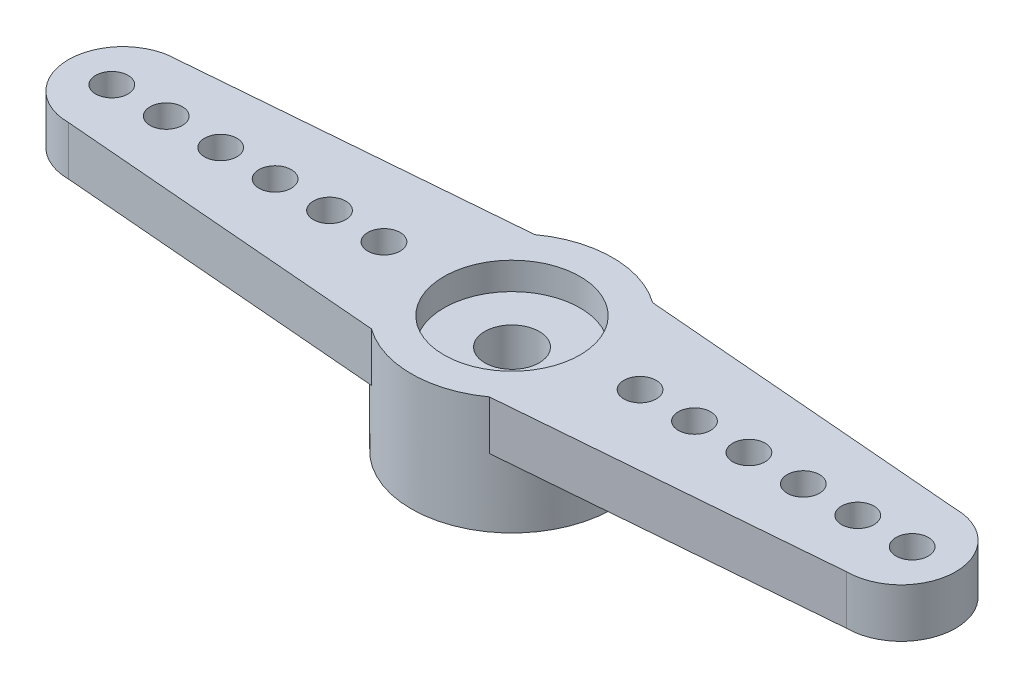
ISO-10303-21;
HEADER;
FILE_DESCRIPTION(('STEP AP214'),'2;1');
FILE_NAME('part.step','',(''),(''),'','','');
FILE_SCHEMA(('AUTOMOTIVE_DESIGN { 1 0 10303 214 1 1 1 1 }'));
ENDSEC;
DATA;
#1=APPLICATION_CONTEXT('core data for automotive mechanical design processes');
#2=APPLICATION_PROTOCOL_DEFINITION('international standard','automotive_design',2000,#1);
#3=PRODUCT_CONTEXT('',#1,'mechanical');
#4=PRODUCT('Part','Part','',(#3));
#5=PRODUCT_RELATED_PRODUCT_CATEGORY('part','',(#4));
#6=PRODUCT_DEFINITION_FORMATION('','',#4);
#7=PRODUCT_DEFINITION_CONTEXT('part definition',#1,'design');
#8=PRODUCT_DEFINITION('design','',#6,#7);
#9=PRODUCT_DEFINITION_SHAPE('','',#8);
#10=(LENGTH_UNIT() NAMED_UNIT(*) SI_UNIT(.MILLI.,.METRE.));
#11=(NAMED_UNIT(*) PLANE_ANGLE_UNIT() SI_UNIT($,.RADIAN.));
#12=(NAMED_UNIT(*) SI_UNIT($,.STERADIAN.) SOLID_ANGLE_UNIT());
#13=UNCERTAINTY_MEASURE_WITH_UNIT(LENGTH_MEASURE(1.E-05),#10,'distance_accuracy_value','');
#14=(GEOMETRIC_REPRESENTATION_CONTEXT(3) GLOBAL_UNCERTAINTY_ASSIGNED_CONTEXT((#13)) GLOBAL_UNIT_ASSIGNED_CONTEXT((#10,
#11,#12)) REPRESENTATION_CONTEXT('',''));
#15=CARTESIAN_POINT('',(0.,0.,0.));
#16=DIRECTION('',(0.,0.,1.));
#17=DIRECTION('',(1.,0.,0.));
#18=AXIS2_PLACEMENT_3D('',#15,#16,#17);
#19=CARTESIAN_POINT('',(0.,4.3,0.));
#20=DIRECTION('',(0.,-1.,0.));
#21=DIRECTION('',(0.,0.,-1.));
#22=AXIS2_PLACEMENT_3D('',#19,#20,#21);
#23=CYLINDRICAL_SURFACE('',#22,3.7);
#24=CARTESIAN_POINT('',(0.,4.3,0.));
#25=DIRECTION('',(0.,1.,0.));
#26=DIRECTION('',(0.,0.,1.));
#27=AXIS2_PLACEMENT_3D('',#24,#25,#26);
#28=CIRCLE('',#27,3.7);
#29=CARTESIAN_POINT('',(2.16564,4.3,-3.00000056506661));
#30=VERTEX_POINT('',#29);
#31=CARTESIAN_POINT('',(-2.16564,4.3,-3.00000056506661));
#32=VERTEX_POINT('',#31);
#33=EDGE_CURVE('E122',#30,#32,#28,.T.);
#34=ORIENTED_EDGE('',*,*,#33,.F.);
#35=DIRECTION('',(0.,1.,0.));
#36=VECTOR('',#35,1.);
#37=CARTESIAN_POINT('',(2.16564,2.5,-3.00000056506661));
#38=LINE('',#37,#36);
#39=CARTESIAN_POINT('',(2.16564,2.5,-3.00000056506661));
#40=VERTEX_POINT('',#39);
#41=EDGE_CURVE('E120',#40,#30,#38,.T.);
#42=ORIENTED_EDGE('',*,*,#41,.F.);
#43=CARTESIAN_POINT('',(0.,2.5,0.));
#44=DIRECTION('',(0.,-1.,0.));
#45=DIRECTION('',(0.,0.,-1.));
#46=AXIS2_PLACEMENT_3D('',#43,#44,#45);
#47=CIRCLE('',#46,3.7);
#48=CARTESIAN_POINT('',(2.16564,2.5,3.00000056506661));
#49=VERTEX_POINT('',#48);
#50=EDGE_CURVE('E11',#40,#49,#47,.T.);
#51=ORIENTED_EDGE('',*,*,#50,.T.);
#52=DIRECTION('',(0.,1.,0.));
#53=VECTOR('',#52,1.);
#54=CARTESIAN_POINT('',(2.16564,2.5,3.00000056506661));
#55=LINE('',#54,#53);
#56=CARTESIAN_POINT('',(2.16564,4.3,3.00000056506661));
#57=VERTEX_POINT('',#56);
#58=EDGE_CURVE('E98',#49,#57,#55,.T.);
#59=ORIENTED_EDGE('',*,*,#58,.T.);
#60=CARTESIAN_POINT('',(-2.16564,4.3,3.00000056506661));
#61=VERTEX_POINT('',#60);
#62=EDGE_CURVE('E173',#61,#57,#28,.T.);
#63=ORIENTED_EDGE('',*,*,#62,.F.);
#64=DIRECTION('',(0.,1.,0.));
#65=VECTOR('',#64,1.);
#66=CARTESIAN_POINT('',(-2.16564,2.5,3.00000056506661));
#67=LINE('',#66,#65);
#68=CARTESIAN_POINT('',(-2.16564,2.5,3.00000056506661));
#69=VERTEX_POINT('',#68);
#70=EDGE_CURVE('E150',#69,#61,#67,.T.);
#71=ORIENTED_EDGE('',*,*,#70,.F.);
#72=CARTESIAN_POINT('',(0.,2.5,0.));
#73=DIRECTION('',(0.,1.,0.));
#74=DIRECTION('',(0.,0.,1.));
#75=AXIS2_PLACEMENT_3D('',#72,#73,#74);
#76=CIRCLE('',#75,3.7);
#77=CARTESIAN_POINT('',(-2.16564,2.5,-3.00000056506661));
#78=VERTEX_POINT('',#77);
#79=EDGE_CURVE('E39',#78,#69,#76,.T.);
#80=ORIENTED_EDGE('',*,*,#79,.F.);
#81=DIRECTION('',(0.,1.,0.));
#82=VECTOR('',#81,1.);
#83=CARTESIAN_POINT('',(-2.16564,2.5,-3.00000056506661));
#84=LINE('',#83,#82);
#85=EDGE_CURVE('E147',#78,#32,#84,.T.);
#86=ORIENTED_EDGE('',*,*,#85,.T.);
#87=EDGE_LOOP('',(#34,#42,#51,#59,#63,#71,#80,#86));
#88=FACE_BOUND('',#87,.T.);
#89=CARTESIAN_POINT('',(0.,0.,0.));
#90=DIRECTION('',(0.,1.,0.));
#91=DIRECTION('',(0.,0.,1.));
#92=AXIS2_PLACEMENT_3D('',#89,#90,#91);
#93=CIRCLE('',#92,3.7);
#94=CARTESIAN_POINT('',(0.,0.,3.7));
#95=VERTEX_POINT('',#94);
#96=EDGE_CURVE('E170',#95,#95,#93,.T.);
#97=ORIENTED_EDGE('',*,*,#96,.T.);
#98=EDGE_LOOP('',(#97));
#99=FACE_BOUND('',#98,.T.);
#100=ADVANCED_FACE('F32',(#88,#99),#23,.T.);
#101=CARTESIAN_POINT('',(0.,4.3,0.));
#102=DIRECTION('',(0.,1.,0.));
#103=DIRECTION('',(0.,0.,1.));
#104=AXIS2_PLACEMENT_3D('',#101,#102,#103);
#105=PLANE('',#104);
#106=CARTESIAN_POINT('',(-12.705,4.3,0.));
#107=DIRECTION('',(0.,1.,0.));
#108=DIRECTION('',(0.,0.,1.));
#109=AXIS2_PLACEMENT_3D('',#106,#107,#108);
#110=CIRCLE('',#109,0.595);
#111=CARTESIAN_POINT('',(-12.705,4.3,0.595000000000002));
#112=VERTEX_POINT('',#111);
#113=EDGE_CURVE('E260',#112,#112,#110,.T.);
#114=ORIENTED_EDGE('',*,*,#113,.F.);
#115=EDGE_LOOP('',(#114));
#116=FACE_BOUND('',#115,.T.);
#117=CARTESIAN_POINT('',(-10.705,4.3,0.));
#118=DIRECTION('',(0.,1.,0.));
#119=DIRECTION('',(0.,0.,1.));
#120=AXIS2_PLACEMENT_3D('',#117,#118,#119);
#121=CIRCLE('',#120,0.595);
#122=CARTESIAN_POINT('',(-10.705,4.3,0.595000000000002));
#123=VERTEX_POINT('',#122);
#124=EDGE_CURVE('E254',#123,#123,#121,.T.);
#125=ORIENTED_EDGE('',*,*,#124,.F.);
#126=EDGE_LOOP('',(#125));
#127=FACE_BOUND('',#126,.T.);
#128=CARTESIAN_POINT('',(-8.705,4.3,0.));
#129=DIRECTION('',(0.,1.,0.));
#130=DIRECTION('',(0.,0.,1.));
#131=AXIS2_PLACEMENT_3D('',#128,#129,#130);
#132=CIRCLE('',#131,0.595);
#133=CARTESIAN_POINT('',(-8.705,4.3,0.595000000000002));
#134=VERTEX_POINT('',#133);
#135=EDGE_CURVE('E248',#134,#134,#132,.T.);
#136=ORIENTED_EDGE('',*,*,#135,.F.);
#137=EDGE_LOOP('',(#136));
#138=FACE_BOUND('',#137,.T.);
#139=CARTESIAN_POINT('',(-6.705,4.3,0.));
#140=DIRECTION('',(0.,1.,0.));
#141=DIRECTION('',(0.,0.,1.));
#142=AXIS2_PLACEMENT_3D('',#139,#140,#141);
#143=CIRCLE('',#142,0.595);
#144=CARTESIAN_POINT('',(-6.705,4.3,0.595000000000002));
#145=VERTEX_POINT('',#144);
#146=EDGE_CURVE('E242',#145,#145,#143,.T.);
#147=ORIENTED_EDGE('',*,*,#146,.F.);
#148=EDGE_LOOP('',(#147));
#149=FACE_BOUND('',#148,.T.);
#150=CARTESIAN_POINT('',(-4.705,4.3,0.));
#151=DIRECTION('',(0.,1.,0.));
#152=DIRECTION('',(0.,0.,1.));
#153=AXIS2_PLACEMENT_3D('',#150,#151,#152);
#154=CIRCLE('',#153,0.595);
#155=CARTESIAN_POINT('',(-4.705,4.3,0.595000000000002));
#156=VERTEX_POINT('',#155);
#157=EDGE_CURVE('E236',#156,#156,#154,.T.);
#158=ORIENTED_EDGE('',*,*,#157,.F.);
#159=EDGE_LOOP('',(#158));
#160=FACE_BOUND('',#159,.T.);
#161=CARTESIAN_POINT('',(14.705,4.3,0.));
#162=DIRECTION('',(0.,1.,0.));
#163=DIRECTION('',(0.,0.,-1.));
#164=AXIS2_PLACEMENT_3D('',#161,#162,#163);
#165=CIRCLE('',#164,0.595);
#166=CARTESIAN_POINT('',(14.705,4.3,-0.594999999999998));
#167=VERTEX_POINT('',#166);
#168=EDGE_CURVE('E230',#167,#167,#165,.T.);
#169=ORIENTED_EDGE('',*,*,#168,.F.);
#170=EDGE_LOOP('',(#169));
#171=FACE_BOUND('',#170,.T.);
#172=CARTESIAN_POINT('',(12.705,4.3,0.));
#173=DIRECTION('',(0.,1.,0.));
#174=DIRECTION('',(0.,0.,-1.));
#175=AXIS2_PLACEMENT_3D('',#172,#173,#174);
#176=CIRCLE('',#175,0.595);
#177=CARTESIAN_POINT('',(12.705,4.3,-0.594999999999998));
#178=VERTEX_POINT('',#177);
#179=EDGE_CURVE('E224',#178,#178,#176,.T.);
#180=ORIENTED_EDGE('',*,*,#179,.F.);
#181=EDGE_LOOP('',(#180));
#182=FACE_BOUND('',#181,.T.);
#183=CARTESIAN_POINT('',(10.705,4.3,0.));
#184=DIRECTION('',(0.,1.,0.));
#185=DIRECTION('',(0.,0.,-1.));
#186=AXIS2_PLACEMENT_3D('',#183,#184,#185);
#187=CIRCLE('',#186,0.595);
#188=CARTESIAN_POINT('',(10.705,4.3,-0.594999999999998));
#189=VERTEX_POINT('',#188);
#190=EDGE_CURVE('E218',#189,#189,#187,.T.);
#191=ORIENTED_EDGE('',*,*,#190,.F.);
#192=EDGE_LOOP('',(#191));
#193=FACE_BOUND('',#192,.T.);
#194=CARTESIAN_POINT('',(8.705,4.3,0.));
#195=DIRECTION('',(0.,1.,0.));
#196=DIRECTION('',(0.,0.,-1.));
#197=AXIS2_PLACEMENT_3D('',#194,#195,#196);
#198=CIRCLE('',#197,0.595);
#199=CARTESIAN_POINT('',(8.705,4.3,-0.594999999999998));
#200=VERTEX_POINT('',#199);
#201=EDGE_CURVE('E212',#200,#200,#198,.T.);
#202=ORIENTED_EDGE('',*,*,#201,.F.);
#203=EDGE_LOOP('',(#202));
#204=FACE_BOUND('',#203,.T.);
#205=CARTESIAN_POINT('',(6.705,4.3,0.));
#206=DIRECTION('',(0.,1.,0.));
#207=DIRECTION('',(0.,0.,-1.));
#208=AXIS2_PLACEMENT_3D('',#205,#206,#207);
#209=CIRCLE('',#208,0.595);
#210=CARTESIAN_POINT('',(6.705,4.3,-0.594999999999998));
#211=VERTEX_POINT('',#210);
#212=EDGE_CURVE('E206',#211,#211,#209,.T.);
#213=ORIENTED_EDGE('',*,*,#212,.F.);
#214=EDGE_LOOP('',(#213));
#215=FACE_BOUND('',#214,.T.);
#216=CARTESIAN_POINT('',(4.705,4.3,0.));
#217=DIRECTION('',(0.,1.,0.));
#218=DIRECTION('',(0.,0.,-1.));
#219=AXIS2_PLACEMENT_3D('',#216,#217,#218);
#220=CIRCLE('',#219,0.595);
#221=CARTESIAN_POINT('',(4.705,4.3,-0.594999999999998));
#222=VERTEX_POINT('',#221);
#223=EDGE_CURVE('E200',#222,#222,#220,.T.);
#224=ORIENTED_EDGE('',*,*,#223,.F.);
#225=EDGE_LOOP('',(#224));
#226=FACE_BOUND('',#225,.T.);
#227=CARTESIAN_POINT('',(-14.705,4.3,0.));
#228=DIRECTION('',(0.,1.,0.));
#229=DIRECTION('',(0.,0.,1.));
#230=AXIS2_PLACEMENT_3D('',#227,#228,#229);
#231=CIRCLE('',#230,0.595);
#232=CARTESIAN_POINT('',(-14.705,4.3,0.595000000000002));
#233=VERTEX_POINT('',#232);
#234=EDGE_CURVE('E192',#233,#233,#231,.T.);
#235=ORIENTED_EDGE('',*,*,#234,.F.);
#236=EDGE_LOOP('',(#235));
#237=FACE_BOUND('',#236,.T.);
#238=ORIENTED_EDGE('',*,*,#62,.T.);
#239=DIRECTION('',(0.996621441352037,0.,-0.0821322265459026));
#240=VECTOR('',#239,1.);
#241=CARTESIAN_POINT('',(2.16564,4.3,3.00000056506661));
#242=LINE('',#241,#240);
#243=CARTESIAN_POINT('',(14.3,4.3,2.));
#244=VERTEX_POINT('',#243);
#245=EDGE_CURVE('E103',#57,#244,#242,.T.);
#246=ORIENTED_EDGE('',*,*,#245,.T.);
#247=CARTESIAN_POINT('',(14.3,4.3,0.));
#248=DIRECTION('',(0.,1.,0.));
#249=DIRECTION('',(0.,0.,-1.));
#250=AXIS2_PLACEMENT_3D('',#247,#248,#249);
#251=CIRCLE('',#250,2.);
#252=CARTESIAN_POINT('',(14.3,4.3,-2.));
#253=VERTEX_POINT('',#252);
#254=EDGE_CURVE('E188',#244,#253,#251,.T.);
#255=ORIENTED_EDGE('',*,*,#254,.T.);
#256=DIRECTION('',(-0.996621441352037,0.,-0.0821322265459028));
#257=VECTOR('',#256,1.);
#258=CARTESIAN_POINT('',(2.16564,4.3,-3.00000056506661));
#259=LINE('',#258,#257);
#260=EDGE_CURVE('E46',#253,#30,#259,.T.);
#261=ORIENTED_EDGE('',*,*,#260,.T.);
#262=ORIENTED_EDGE('',*,*,#33,.T.);
#263=DIRECTION('',(-0.996621441352037,0.,0.0821322265459028));
#264=VECTOR('',#263,1.);
#265=CARTESIAN_POINT('',(-2.16564,4.3,-3.00000056506661));
#266=LINE('',#265,#264);
#267=CARTESIAN_POINT('',(-14.3,4.3,-2.));
#268=VERTEX_POINT('',#267);
#269=EDGE_CURVE('E124',#32,#268,#266,.T.);
#270=ORIENTED_EDGE('',*,*,#269,.T.);
#271=CARTESIAN_POINT('',(-14.3,4.3,0.));
#272=DIRECTION('',(0.,1.,0.));
#273=DIRECTION('',(0.,0.,1.));
#274=AXIS2_PLACEMENT_3D('',#271,#272,#273);
#275=CIRCLE('',#274,2.);
#276=CARTESIAN_POINT('',(-14.3,4.3,2.));
#277=VERTEX_POINT('',#276);
#278=EDGE_CURVE('E128',#268,#277,#275,.T.);
#279=ORIENTED_EDGE('',*,*,#278,.T.);
#280=DIRECTION('',(0.996621441352037,0.,0.0821322265459026));
#281=VECTOR('',#280,1.);
#282=CARTESIAN_POINT('',(-2.16564,4.3,3.00000056506661));
#283=LINE('',#282,#281);
#284=EDGE_CURVE('E53',#277,#61,#283,.T.);
#285=ORIENTED_EDGE('',*,*,#284,.T.);
#286=EDGE_LOOP('',(#238,#246,#255,#261,#262,#270,#279,#285));
#287=FACE_BOUND('',#286,.T.);
#288=CARTESIAN_POINT('',(0.,4.3,0.));
#289=DIRECTION('',(0.,1.,0.));
#290=DIRECTION('',(0.,0.,1.));
#291=AXIS2_PLACEMENT_3D('',#288,#289,#290);
#292=CIRCLE('',#291,2.5);
#293=CARTESIAN_POINT('',(0.,4.3,2.5));
#294=VERTEX_POINT('',#293);
#295=EDGE_CURVE('E158',#294,#294,#292,.T.);
#296=ORIENTED_EDGE('',*,*,#295,.F.);
#297=EDGE_LOOP('',(#296));
#298=FACE_BOUND('',#297,.T.);
#299=ADVANCED_FACE('F185',(#116,#127,#138,#149,#160,#171,#182,#193,#204,#215,#226,#237,#287,
#298),#105,.T.);
#300=CARTESIAN_POINT('',(0.,0.,0.));
#301=DIRECTION('',(0.,1.,0.));
#302=DIRECTION('',(0.,0.,1.));
#303=AXIS2_PLACEMENT_3D('',#300,#301,#302);
#304=PLANE('',#303);
#305=CARTESIAN_POINT('',(0.,0.,0.));
#306=DIRECTION('',(0.,-1.,0.));
#307=DIRECTION('',(0.,0.,-1.));
#308=AXIS2_PLACEMENT_3D('',#305,#306,#307);
#309=CIRCLE('',#308,2.5);
#310=CARTESIAN_POINT('',(0.,0.,-2.5));
#311=VERTEX_POINT('',#310);
#312=EDGE_CURVE('E164',#311,#311,#309,.T.);
#313=ORIENTED_EDGE('',*,*,#312,.F.);
#314=EDGE_LOOP('',(#313));
#315=FACE_BOUND('',#314,.T.);
#316=ORIENTED_EDGE('',*,*,#96,.F.);
#317=EDGE_LOOP('',(#316));
#318=FACE_BOUND('',#317,.T.);
#319=ADVANCED_FACE('F277',(#315,#318),#304,.F.);
#320=CARTESIAN_POINT('',(0.,1.5,0.));
#321=DIRECTION('',(0.,-1.,0.));
#322=DIRECTION('',(0.,0.,-1.));
#323=AXIS2_PLACEMENT_3D('',#320,#321,#322);
#324=CYLINDRICAL_SURFACE('',#323,2.5);
#325=CARTESIAN_POINT('',(0.,1.5,0.));
#326=DIRECTION('',(0.,-1.,0.));
#327=DIRECTION('',(0.,0.,-1.));
#328=AXIS2_PLACEMENT_3D('',#325,#326,#327);
#329=CIRCLE('',#328,2.5);
#330=CARTESIAN_POINT('',(0.,1.5,-2.5));
#331=VERTEX_POINT('',#330);
#332=EDGE_CURVE('E167',#331,#331,#329,.T.);
#333=ORIENTED_EDGE('',*,*,#332,.F.);
#334=EDGE_LOOP('',(#333));
#335=FACE_BOUND('',#334,.T.);
#336=ORIENTED_EDGE('',*,*,#312,.T.);
#337=EDGE_LOOP('',(#336));
#338=FACE_BOUND('',#337,.T.);
#339=ADVANCED_FACE('F551',(#335,#338),#324,.F.);
#340=CARTESIAN_POINT('',(0.,1.5,0.));
#341=DIRECTION('',(0.,-1.,0.));
#342=DIRECTION('',(0.,0.,-1.));
#343=AXIS2_PLACEMENT_3D('',#340,#341,#342);
#344=PLANE('',#343);
#345=CARTESIAN_POINT('',(0.,1.5,0.));
#346=DIRECTION('',(0.,1.,0.));
#347=DIRECTION('',(0.,0.,1.));
#348=AXIS2_PLACEMENT_3D('',#345,#346,#347);
#349=CIRCLE('',#348,1.);
#350=CARTESIAN_POINT('',(0.,1.5,1.));
#351=VERTEX_POINT('',#350);
#352=EDGE_CURVE('E155',#351,#351,#349,.T.);
#353=ORIENTED_EDGE('',*,*,#352,.T.);
#354=EDGE_LOOP('',(#353));
#355=FACE_BOUND('',#354,.T.);
#356=ORIENTED_EDGE('',*,*,#332,.T.);
#357=EDGE_LOOP('',(#356));
#358=FACE_BOUND('',#357,.T.);
#359=ADVANCED_FACE('F547',(#355,#358),#344,.T.);
#360=CARTESIAN_POINT('',(0.,3.3,0.));
#361=DIRECTION('',(0.,1.,0.));
#362=DIRECTION('',(0.,0.,1.));
#363=AXIS2_PLACEMENT_3D('',#360,#361,#362);
#364=CYLINDRICAL_SURFACE('',#363,2.5);
#365=CARTESIAN_POINT('',(0.,3.3,0.));
#366=DIRECTION('',(0.,1.,0.));
#367=DIRECTION('',(0.,0.,1.));
#368=AXIS2_PLACEMENT_3D('',#365,#366,#367);
#369=CIRCLE('',#368,2.5);
#370=CARTESIAN_POINT('',(0.,3.3,2.5));
#371=VERTEX_POINT('',#370);
#372=EDGE_CURVE('E161',#371,#371,#369,.T.);
#373=ORIENTED_EDGE('',*,*,#372,.F.);
#374=EDGE_LOOP('',(#373));
#375=FACE_BOUND('',#374,.T.);
#376=ORIENTED_EDGE('',*,*,#295,.T.);
#377=EDGE_LOOP('',(#376));
#378=FACE_BOUND('',#377,.T.);
#379=ADVANCED_FACE('F543',(#375,#378),#364,.F.);
#380=CARTESIAN_POINT('',(0.,3.3,0.));
#381=DIRECTION('',(0.,1.,0.));
#382=DIRECTION('',(0.,0.,1.));
#383=AXIS2_PLACEMENT_3D('',#380,#381,#382);
#384=PLANE('',#383);
#385=CARTESIAN_POINT('',(0.,3.3,0.));
#386=DIRECTION('',(0.,1.,0.));
#387=DIRECTION('',(0.,0.,1.));
#388=AXIS2_PLACEMENT_3D('',#385,#386,#387);
#389=CIRCLE('',#388,1.);
#390=CARTESIAN_POINT('',(0.,3.3,1.));
#391=VERTEX_POINT('',#390);
#392=EDGE_CURVE('E149',#391,#391,#389,.T.);
#393=ORIENTED_EDGE('',*,*,#392,.F.);
#394=EDGE_LOOP('',(#393));
#395=FACE_BOUND('',#394,.T.);
#396=ORIENTED_EDGE('',*,*,#372,.T.);
#397=EDGE_LOOP('',(#396));
#398=FACE_BOUND('',#397,.T.);
#399=ADVANCED_FACE('F539',(#395,#398),#384,.T.);
#400=CARTESIAN_POINT('',(0.,1.5,0.));
#401=DIRECTION('',(0.,1.,0.));
#402=DIRECTION('',(0.,0.,1.));
#403=AXIS2_PLACEMENT_3D('',#400,#401,#402);
#404=CYLINDRICAL_SURFACE('',#403,1.);
#405=ORIENTED_EDGE('',*,*,#352,.F.);
#406=EDGE_LOOP('',(#405));
#407=FACE_BOUND('',#406,.T.);
#408=ORIENTED_EDGE('',*,*,#392,.T.);
#409=EDGE_LOOP('',(#408));
#410=FACE_BOUND('',#409,.T.);
#411=ADVANCED_FACE('F324',(#407,#410),#404,.F.);
#412=CARTESIAN_POINT('',(-2.16564,2.5,-3.00000056506661));
#413=DIRECTION('',(-0.0821322265459028,0.,-0.996621441352037));
#414=DIRECTION('',(-0.996621441352037,0.,0.0821322265459028));
#415=AXIS2_PLACEMENT_3D('',#412,#413,#414);
#416=PLANE('',#415);
#417=ORIENTED_EDGE('',*,*,#269,.F.);
#418=ORIENTED_EDGE('',*,*,#85,.F.);
#419=DIRECTION('',(-0.996621441352037,0.,0.0821322265459028));
#420=VECTOR('',#419,1.);
#421=CARTESIAN_POINT('',(-2.16564,2.5,-3.00000056506661));
#422=LINE('',#421,#420);
#423=CARTESIAN_POINT('',(-14.3,2.5,-2.));
#424=VERTEX_POINT('',#423);
#425=EDGE_CURVE('E135',#78,#424,#422,.T.);
#426=ORIENTED_EDGE('',*,*,#425,.T.);
#427=DIRECTION('',(0.,1.,0.));
#428=VECTOR('',#427,1.);
#429=CARTESIAN_POINT('',(-14.3,2.5,-2.));
#430=LINE('',#429,#428);
#431=EDGE_CURVE('E143',#424,#268,#430,.T.);
#432=ORIENTED_EDGE('',*,*,#431,.T.);
#433=EDGE_LOOP('',(#417,#418,#426,#432));
#434=FACE_BOUND('',#433,.T.);
#435=ADVANCED_FACE('F329',(#434),#416,.T.);
#436=CARTESIAN_POINT('',(-2.16564,2.5,3.00000056506661));
#437=DIRECTION('',(-0.0821322265459026,0.,0.996621441352037));
#438=DIRECTION('',(0.996621441352037,0.,0.0821322265459026));
#439=AXIS2_PLACEMENT_3D('',#436,#437,#438);
#440=PLANE('',#439);
#441=ORIENTED_EDGE('',*,*,#284,.F.);
#442=DIRECTION('',(0.,1.,0.));
#443=VECTOR('',#442,1.);
#444=CARTESIAN_POINT('',(-14.3,2.5,2.));
#445=LINE('',#444,#443);
#446=CARTESIAN_POINT('',(-14.3,2.5,2.));
#447=VERTEX_POINT('',#446);
#448=EDGE_CURVE('E152',#447,#277,#445,.T.);
#449=ORIENTED_EDGE('',*,*,#448,.F.);
#450=DIRECTION('',(0.996621441352037,0.,0.0821322265459026));
#451=VECTOR('',#450,1.);
#452=CARTESIAN_POINT('',(-2.16564,2.5,3.00000056506661));
#453=LINE('',#452,#451);
#454=EDGE_CURVE('E141',#447,#69,#453,.T.);
#455=ORIENTED_EDGE('',*,*,#454,.T.);
#456=ORIENTED_EDGE('',*,*,#70,.T.);
#457=EDGE_LOOP('',(#441,#449,#455,#456));
#458=FACE_BOUND('',#457,.T.);
#459=ADVANCED_FACE('F184',(#458),#440,.T.);
#460=CARTESIAN_POINT('',(-14.3,2.5,0.));
#461=DIRECTION('',(0.,1.,0.));
#462=DIRECTION('',(0.,0.,1.));
#463=AXIS2_PLACEMENT_3D('',#460,#461,#462);
#464=CYLINDRICAL_SURFACE('',#463,2.);
#465=ORIENTED_EDGE('',*,*,#278,.F.);
#466=ORIENTED_EDGE('',*,*,#431,.F.);
#467=CARTESIAN_POINT('',(-14.3,2.5,0.));
#468=DIRECTION('',(0.,1.,0.));
#469=DIRECTION('',(0.,0.,1.));
#470=AXIS2_PLACEMENT_3D('',#467,#468,#469);
#471=CIRCLE('',#470,2.);
#472=EDGE_CURVE('E138',#424,#447,#471,.T.);
#473=ORIENTED_EDGE('',*,*,#472,.T.);
#474=ORIENTED_EDGE('',*,*,#448,.T.);
#475=EDGE_LOOP('',(#465,#466,#473,#474));
#476=FACE_BOUND('',#475,.T.);
#477=ADVANCED_FACE('F344',(#476),#464,.T.);
#478=CARTESIAN_POINT('',(-14.3,2.5,0.));
#479=DIRECTION('',(0.,1.,0.));
#480=DIRECTION('',(0.,0.,1.));
#481=AXIS2_PLACEMENT_3D('',#478,#479,#480);
#482=PLANE('',#481);
#483=CARTESIAN_POINT('',(-12.705,2.5,0.));
#484=DIRECTION('',(0.,1.,0.));
#485=DIRECTION('',(0.,0.,1.));
#486=AXIS2_PLACEMENT_3D('',#483,#484,#485);
#487=CIRCLE('',#486,0.595);
#488=CARTESIAN_POINT('',(-12.705,2.5,0.595000000000002));
#489=VERTEX_POINT('',#488);
#490=EDGE_CURVE('E198',#489,#489,#487,.T.);
#491=ORIENTED_EDGE('',*,*,#490,.T.);
#492=EDGE_LOOP('',(#491));
#493=FACE_BOUND('',#492,.T.);
#494=CARTESIAN_POINT('',(-10.705,2.5,0.));
#495=DIRECTION('',(0.,1.,0.));
#496=DIRECTION('',(0.,0.,1.));
#497=AXIS2_PLACEMENT_3D('',#494,#495,#496);
#498=CIRCLE('',#497,0.595);
#499=CARTESIAN_POINT('',(-10.705,2.5,0.595000000000002));
#500=VERTEX_POINT('',#499);
#501=EDGE_CURVE('E257',#500,#500,#498,.T.);
#502=ORIENTED_EDGE('',*,*,#501,.T.);
#503=EDGE_LOOP('',(#502));
#504=FACE_BOUND('',#503,.T.);
#505=CARTESIAN_POINT('',(-8.705,2.5,0.));
#506=DIRECTION('',(0.,1.,0.));
#507=DIRECTION('',(0.,0.,1.));
#508=AXIS2_PLACEMENT_3D('',#505,#506,#507);
#509=CIRCLE('',#508,0.595);
#510=CARTESIAN_POINT('',(-8.705,2.5,0.595000000000002));
#511=VERTEX_POINT('',#510);
#512=EDGE_CURVE('E251',#511,#511,#509,.T.);
#513=ORIENTED_EDGE('',*,*,#512,.T.);
#514=EDGE_LOOP('',(#513));
#515=FACE_BOUND('',#514,.T.);
#516=CARTESIAN_POINT('',(-6.705,2.5,0.));
#517=DIRECTION('',(0.,1.,0.));
#518=DIRECTION('',(0.,0.,1.));
#519=AXIS2_PLACEMENT_3D('',#516,#517,#518);
#520=CIRCLE('',#519,0.595);
#521=CARTESIAN_POINT('',(-6.705,2.5,0.595000000000002));
#522=VERTEX_POINT('',#521);
#523=EDGE_CURVE('E245',#522,#522,#520,.T.);
#524=ORIENTED_EDGE('',*,*,#523,.T.);
#525=EDGE_LOOP('',(#524));
#526=FACE_BOUND('',#525,.T.);
#527=CARTESIAN_POINT('',(-4.705,2.5,0.));
#528=DIRECTION('',(0.,1.,0.));
#529=DIRECTION('',(0.,0.,1.));
#530=AXIS2_PLACEMENT_3D('',#527,#528,#529);
#531=CIRCLE('',#530,0.595);
#532=CARTESIAN_POINT('',(-4.705,2.5,0.595000000000002));
#533=VERTEX_POINT('',#532);
#534=EDGE_CURVE('E239',#533,#533,#531,.T.);
#535=ORIENTED_EDGE('',*,*,#534,.T.);
#536=EDGE_LOOP('',(#535));
#537=FACE_BOUND('',#536,.T.);
#538=CARTESIAN_POINT('',(-14.705,2.5,0.));
#539=DIRECTION('',(0.,1.,0.));
#540=DIRECTION('',(0.,0.,1.));
#541=AXIS2_PLACEMENT_3D('',#538,#539,#540);
#542=CIRCLE('',#541,0.595);
#543=CARTESIAN_POINT('',(-14.705,2.5,0.595000000000002));
#544=VERTEX_POINT('',#543);
#545=EDGE_CURVE('E189',#544,#544,#542,.T.);
#546=ORIENTED_EDGE('',*,*,#545,.T.);
#547=EDGE_LOOP('',(#546));
#548=FACE_BOUND('',#547,.T.);
#549=ORIENTED_EDGE('',*,*,#425,.F.);
#550=ORIENTED_EDGE('',*,*,#79,.T.);
#551=ORIENTED_EDGE('',*,*,#454,.F.);
#552=ORIENTED_EDGE('',*,*,#472,.F.);
#553=EDGE_LOOP('',(#549,#550,#551,#552));
#554=FACE_BOUND('',#553,.T.);
#555=ADVANCED_FACE('F180',(#493,#504,#515,#526,#537,#548,#554),#482,.F.);
#556=CARTESIAN_POINT('',(2.16564,2.5,-3.00000056506661));
#557=DIRECTION('',(0.0821322265459028,0.,-0.996621441352037));
#558=DIRECTION('',(-0.996621441352037,0.,-0.0821322265459028));
#559=AXIS2_PLACEMENT_3D('',#556,#557,#558);
#560=PLANE('',#559);
#561=ORIENTED_EDGE('',*,*,#260,.F.);
#562=DIRECTION('',(0.,1.,0.));
#563=VECTOR('',#562,1.);
#564=CARTESIAN_POINT('',(14.3,2.5,-2.));
#565=LINE('',#564,#563);
#566=CARTESIAN_POINT('',(14.3,2.5,-2.));
#567=VERTEX_POINT('',#566);
#568=EDGE_CURVE('E125',#567,#253,#565,.T.);
#569=ORIENTED_EDGE('',*,*,#568,.F.);
#570=DIRECTION('',(-0.996621441352037,0.,-0.0821322265459028));
#571=VECTOR('',#570,1.);
#572=CARTESIAN_POINT('',(2.16564,2.5,-3.00000056506661));
#573=LINE('',#572,#571);
#574=EDGE_CURVE('E107',#567,#40,#573,.T.);
#575=ORIENTED_EDGE('',*,*,#574,.T.);
#576=ORIENTED_EDGE('',*,*,#41,.T.);
#577=EDGE_LOOP('',(#561,#569,#575,#576));
#578=FACE_BOUND('',#577,.T.);
#579=ADVANCED_FACE('F360',(#578),#560,.T.);
#580=CARTESIAN_POINT('',(14.3,2.5,0.));
#581=DIRECTION('',(0.,1.,0.));
#582=DIRECTION('',(0.,0.,1.));
#583=AXIS2_PLACEMENT_3D('',#580,#581,#582);
#584=CYLINDRICAL_SURFACE('',#583,2.);
#585=ORIENTED_EDGE('',*,*,#254,.F.);
#586=DIRECTION('',(0.,1.,0.));
#587=VECTOR('',#586,1.);
#588=CARTESIAN_POINT('',(14.3,2.5,2.));
#589=LINE('',#588,#587);
#590=CARTESIAN_POINT('',(14.3,2.5,2.));
#591=VERTEX_POINT('',#590);
#592=EDGE_CURVE('E106',#591,#244,#589,.T.);
#593=ORIENTED_EDGE('',*,*,#592,.F.);
#594=CARTESIAN_POINT('',(14.3,2.5,0.));
#595=DIRECTION('',(0.,1.,0.));
#596=DIRECTION('',(0.,0.,-1.));
#597=AXIS2_PLACEMENT_3D('',#594,#595,#596);
#598=CIRCLE('',#597,2.);
#599=EDGE_CURVE('E115',#591,#567,#598,.T.);
#600=ORIENTED_EDGE('',*,*,#599,.T.);
#601=ORIENTED_EDGE('',*,*,#568,.T.);
#602=EDGE_LOOP('',(#585,#593,#600,#601));
#603=FACE_BOUND('',#602,.T.);
#604=ADVANCED_FACE('F365',(#603),#584,.T.);
#605=CARTESIAN_POINT('',(2.16564,2.5,3.00000056506661));
#606=DIRECTION('',(0.0821322265459026,0.,0.996621441352037));
#607=DIRECTION('',(0.996621441352037,0.,-0.0821322265459026));
#608=AXIS2_PLACEMENT_3D('',#605,#606,#607);
#609=PLANE('',#608);
#610=ORIENTED_EDGE('',*,*,#245,.F.);
#611=ORIENTED_EDGE('',*,*,#58,.F.);
#612=DIRECTION('',(0.996621441352037,0.,-0.0821322265459026));
#613=VECTOR('',#612,1.);
#614=CARTESIAN_POINT('',(2.16564,2.5,3.00000056506661));
#615=LINE('',#614,#613);
#616=EDGE_CURVE('E101',#49,#591,#615,.T.);
#617=ORIENTED_EDGE('',*,*,#616,.T.);
#618=ORIENTED_EDGE('',*,*,#592,.T.);
#619=EDGE_LOOP('',(#610,#611,#617,#618));
#620=FACE_BOUND('',#619,.T.);
#621=ADVANCED_FACE('F100',(#620),#609,.T.);
#622=CARTESIAN_POINT('',(14.3,2.5,0.));
#623=DIRECTION('',(0.,-1.,0.));
#624=DIRECTION('',(0.,0.,-1.));
#625=AXIS2_PLACEMENT_3D('',#622,#623,#624);
#626=PLANE('',#625);
#627=CARTESIAN_POINT('',(14.705,2.5,0.));
#628=DIRECTION('',(0.,1.,0.));
#629=DIRECTION('',(0.,0.,-1.));
#630=AXIS2_PLACEMENT_3D('',#627,#628,#629);
#631=CIRCLE('',#630,0.595);
#632=CARTESIAN_POINT('',(14.705,2.5,-0.594999999999998));
#633=VERTEX_POINT('',#632);
#634=EDGE_CURVE('E233',#633,#633,#631,.T.);
#635=ORIENTED_EDGE('',*,*,#634,.T.);
#636=EDGE_LOOP('',(#635));
#637=FACE_BOUND('',#636,.T.);
#638=CARTESIAN_POINT('',(12.705,2.5,0.));
#639=DIRECTION('',(0.,1.,0.));
#640=DIRECTION('',(0.,0.,-1.));
#641=AXIS2_PLACEMENT_3D('',#638,#639,#640);
#642=CIRCLE('',#641,0.595);
#643=CARTESIAN_POINT('',(12.705,2.5,-0.594999999999998));
#644=VERTEX_POINT('',#643);
#645=EDGE_CURVE('E227',#644,#644,#642,.T.);
#646=ORIENTED_EDGE('',*,*,#645,.T.);
#647=EDGE_LOOP('',(#646));
#648=FACE_BOUND('',#647,.T.);
#649=CARTESIAN_POINT('',(10.705,2.5,0.));
#650=DIRECTION('',(0.,1.,0.));
#651=DIRECTION('',(0.,0.,-1.));
#652=AXIS2_PLACEMENT_3D('',#649,#650,#651);
#653=CIRCLE('',#652,0.595);
#654=CARTESIAN_POINT('',(10.705,2.5,-0.594999999999998));
#655=VERTEX_POINT('',#654);
#656=EDGE_CURVE('E221',#655,#655,#653,.T.);
#657=ORIENTED_EDGE('',*,*,#656,.T.);
#658=EDGE_LOOP('',(#657));
#659=FACE_BOUND('',#658,.T.);
#660=CARTESIAN_POINT('',(8.705,2.5,0.));
#661=DIRECTION('',(0.,1.,0.));
#662=DIRECTION('',(0.,0.,-1.));
#663=AXIS2_PLACEMENT_3D('',#660,#661,#662);
#664=CIRCLE('',#663,0.595);
#665=CARTESIAN_POINT('',(8.705,2.5,-0.594999999999998));
#666=VERTEX_POINT('',#665);
#667=EDGE_CURVE('E215',#666,#666,#664,.T.);
#668=ORIENTED_EDGE('',*,*,#667,.T.);
#669=EDGE_LOOP('',(#668));
#670=FACE_BOUND('',#669,.T.);
#671=CARTESIAN_POINT('',(6.705,2.5,0.));
#672=DIRECTION('',(0.,1.,0.));
#673=DIRECTION('',(0.,0.,-1.));
#674=AXIS2_PLACEMENT_3D('',#671,#672,#673);
#675=CIRCLE('',#674,0.595);
#676=CARTESIAN_POINT('',(6.705,2.5,-0.594999999999998));
#677=VERTEX_POINT('',#676);
#678=EDGE_CURVE('E209',#677,#677,#675,.T.);
#679=ORIENTED_EDGE('',*,*,#678,.T.);
#680=EDGE_LOOP('',(#679));
#681=FACE_BOUND('',#680,.T.);
#682=CARTESIAN_POINT('',(4.705,2.5,0.));
#683=DIRECTION('',(0.,1.,0.));
#684=DIRECTION('',(0.,0.,-1.));
#685=AXIS2_PLACEMENT_3D('',#682,#683,#684);
#686=CIRCLE('',#685,0.595);
#687=CARTESIAN_POINT('',(4.705,2.5,-0.594999999999998));
#688=VERTEX_POINT('',#687);
#689=EDGE_CURVE('E203',#688,#688,#686,.T.);
#690=ORIENTED_EDGE('',*,*,#689,.T.);
#691=EDGE_LOOP('',(#690));
#692=FACE_BOUND('',#691,.T.);
#693=ORIENTED_EDGE('',*,*,#50,.F.);
#694=ORIENTED_EDGE('',*,*,#574,.F.);
#695=ORIENTED_EDGE('',*,*,#599,.F.);
#696=ORIENTED_EDGE('',*,*,#616,.F.);
#697=EDGE_LOOP('',(#693,#694,#695,#696));
#698=FACE_BOUND('',#697,.T.);
#699=ADVANCED_FACE('F111',(#637,#648,#659,#670,#681,#692,#698),#626,.T.);
#700=CARTESIAN_POINT('',(-14.705,2.5,0.));
#701=DIRECTION('',(0.,1.,0.));
#702=DIRECTION('',(0.,0.,1.));
#703=AXIS2_PLACEMENT_3D('',#700,#701,#702);
#704=CYLINDRICAL_SURFACE('',#703,0.595);
#705=ORIENTED_EDGE('',*,*,#545,.F.);
#706=EDGE_LOOP('',(#705));
#707=FACE_BOUND('',#706,.T.);
#708=ORIENTED_EDGE('',*,*,#234,.T.);
#709=EDGE_LOOP('',(#708));
#710=FACE_BOUND('',#709,.T.);
#711=ADVANCED_FACE('F301',(#707,#710),#704,.F.);
#712=CARTESIAN_POINT('',(4.705,2.5,0.));
#713=DIRECTION('',(0.,1.,0.));
#714=DIRECTION('',(0.,0.,1.));
#715=AXIS2_PLACEMENT_3D('',#712,#713,#714);
#716=CYLINDRICAL_SURFACE('',#715,0.595);
#717=ORIENTED_EDGE('',*,*,#689,.F.);
#718=EDGE_LOOP('',(#717));
#719=FACE_BOUND('',#718,.T.);
#720=ORIENTED_EDGE('',*,*,#223,.T.);
#721=EDGE_LOOP('',(#720));
#722=FACE_BOUND('',#721,.T.);
#723=ADVANCED_FACE('F303',(#719,#722),#716,.F.);
#724=CARTESIAN_POINT('',(6.705,2.5,0.));
#725=DIRECTION('',(0.,1.,0.));
#726=DIRECTION('',(0.,0.,1.));
#727=AXIS2_PLACEMENT_3D('',#724,#725,#726);
#728=CYLINDRICAL_SURFACE('',#727,0.595);
#729=ORIENTED_EDGE('',*,*,#678,.F.);
#730=EDGE_LOOP('',(#729));
#731=FACE_BOUND('',#730,.T.);
#732=ORIENTED_EDGE('',*,*,#212,.T.);
#733=EDGE_LOOP('',(#732));
#734=FACE_BOUND('',#733,.T.);
#735=ADVANCED_FACE('F310',(#731,#734),#728,.F.);
#736=CARTESIAN_POINT('',(8.705,2.5,0.));
#737=DIRECTION('',(0.,1.,0.));
#738=DIRECTION('',(0.,0.,1.));
#739=AXIS2_PLACEMENT_3D('',#736,#737,#738);
#740=CYLINDRICAL_SURFACE('',#739,0.595);
#741=ORIENTED_EDGE('',*,*,#667,.F.);
#742=EDGE_LOOP('',(#741));
#743=FACE_BOUND('',#742,.T.);
#744=ORIENTED_EDGE('',*,*,#201,.T.);
#745=EDGE_LOOP('',(#744));
#746=FACE_BOUND('',#745,.T.);
#747=ADVANCED_FACE('F419',(#743,#746),#740,.F.);
#748=CARTESIAN_POINT('',(10.705,2.5,0.));
#749=DIRECTION('',(0.,1.,0.));
#750=DIRECTION('',(0.,0.,1.));
#751=AXIS2_PLACEMENT_3D('',#748,#749,#750);
#752=CYLINDRICAL_SURFACE('',#751,0.595);
#753=ORIENTED_EDGE('',*,*,#656,.F.);
#754=EDGE_LOOP('',(#753));
#755=FACE_BOUND('',#754,.T.);
#756=ORIENTED_EDGE('',*,*,#190,.T.);
#757=EDGE_LOOP('',(#756));
#758=FACE_BOUND('',#757,.T.);
#759=ADVANCED_FACE('F429',(#755,#758),#752,.F.);
#760=CARTESIAN_POINT('',(12.705,2.5,0.));
#761=DIRECTION('',(0.,1.,0.));
#762=DIRECTION('',(0.,0.,1.));
#763=AXIS2_PLACEMENT_3D('',#760,#761,#762);
#764=CYLINDRICAL_SURFACE('',#763,0.595);
#765=ORIENTED_EDGE('',*,*,#645,.F.);
#766=EDGE_LOOP('',(#765));
#767=FACE_BOUND('',#766,.T.);
#768=ORIENTED_EDGE('',*,*,#179,.T.);
#769=EDGE_LOOP('',(#768));
#770=FACE_BOUND('',#769,.T.);
#771=ADVANCED_FACE('F439',(#767,#770),#764,.F.);
#772=CARTESIAN_POINT('',(14.705,2.5,0.));
#773=DIRECTION('',(0.,1.,0.));
#774=DIRECTION('',(0.,0.,1.));
#775=AXIS2_PLACEMENT_3D('',#772,#773,#774);
#776=CYLINDRICAL_SURFACE('',#775,0.595);
#777=ORIENTED_EDGE('',*,*,#634,.F.);
#778=EDGE_LOOP('',(#777));
#779=FACE_BOUND('',#778,.T.);
#780=ORIENTED_EDGE('',*,*,#168,.T.);
#781=EDGE_LOOP('',(#780));
#782=FACE_BOUND('',#781,.T.);
#783=ADVANCED_FACE('F449',(#779,#782),#776,.F.);
#784=CARTESIAN_POINT('',(-4.705,2.5,0.));
#785=DIRECTION('',(0.,1.,0.));
#786=DIRECTION('',(0.,0.,1.));
#787=AXIS2_PLACEMENT_3D('',#784,#785,#786);
#788=CYLINDRICAL_SURFACE('',#787,0.595);
#789=ORIENTED_EDGE('',*,*,#534,.F.);
#790=EDGE_LOOP('',(#789));
#791=FACE_BOUND('',#790,.T.);
#792=ORIENTED_EDGE('',*,*,#157,.T.);
#793=EDGE_LOOP('',(#792));
#794=FACE_BOUND('',#793,.T.);
#795=ADVANCED_FACE('F459',(#791,#794),#788,.F.);
#796=CARTESIAN_POINT('',(-6.705,2.5,0.));
#797=DIRECTION('',(0.,1.,0.));
#798=DIRECTION('',(0.,0.,1.));
#799=AXIS2_PLACEMENT_3D('',#796,#797,#798);
#800=CYLINDRICAL_SURFACE('',#799,0.595);
#801=ORIENTED_EDGE('',*,*,#523,.F.);
#802=EDGE_LOOP('',(#801));
#803=FACE_BOUND('',#802,.T.);
#804=ORIENTED_EDGE('',*,*,#146,.T.);
#805=EDGE_LOOP('',(#804));
#806=FACE_BOUND('',#805,.T.);
#807=ADVANCED_FACE('F469',(#803,#806),#800,.F.);
#808=CARTESIAN_POINT('',(-8.705,2.5,0.));
#809=DIRECTION('',(0.,1.,0.));
#810=DIRECTION('',(0.,0.,1.));
#811=AXIS2_PLACEMENT_3D('',#808,#809,#810);
#812=CYLINDRICAL_SURFACE('',#811,0.595);
#813=ORIENTED_EDGE('',*,*,#512,.F.);
#814=EDGE_LOOP('',(#813));
#815=FACE_BOUND('',#814,.T.);
#816=ORIENTED_EDGE('',*,*,#135,.T.);
#817=EDGE_LOOP('',(#816));
#818=FACE_BOUND('',#817,.T.);
#819=ADVANCED_FACE('F479',(#815,#818),#812,.F.);
#820=CARTESIAN_POINT('',(-10.705,2.5,0.));
#821=DIRECTION('',(0.,1.,0.));
#822=DIRECTION('',(0.,0.,1.));
#823=AXIS2_PLACEMENT_3D('',#820,#821,#822);
#824=CYLINDRICAL_SURFACE('',#823,0.595);
#825=ORIENTED_EDGE('',*,*,#501,.F.);
#826=EDGE_LOOP('',(#825));
#827=FACE_BOUND('',#826,.T.);
#828=ORIENTED_EDGE('',*,*,#124,.T.);
#829=EDGE_LOOP('',(#828));
#830=FACE_BOUND('',#829,.T.);
#831=ADVANCED_FACE('F271',(#827,#830),#824,.F.);
#832=CARTESIAN_POINT('',(-12.705,2.5,0.));
#833=DIRECTION('',(0.,1.,0.));
#834=DIRECTION('',(0.,0.,1.));
#835=AXIS2_PLACEMENT_3D('',#832,#833,#834);
#836=CYLINDRICAL_SURFACE('',#835,0.595);
#837=ORIENTED_EDGE('',*,*,#490,.F.);
#838=EDGE_LOOP('',(#837));
#839=FACE_BOUND('',#838,.T.);
#840=ORIENTED_EDGE('',*,*,#113,.T.);
#841=EDGE_LOOP('',(#840));
#842=FACE_BOUND('',#841,.T.);
#843=ADVANCED_FACE('F268',(#839,#842),#836,.F.);
#844=CLOSED_SHELL('',(#100,#299,#319,#339,#359,#379,#399,#411,#435,#459,#477,#555,#579,#604,
#621,#699,#711,#723,#735,#747,#759,#771,#783,#795,#807,#819,#831,#843));
#845=MANIFOLD_SOLID_BREP('B2',#844);
#846=ADVANCED_BREP_SHAPE_REPRESENTATION('',(#18,#845),#14);
#847=SHAPE_DEFINITION_REPRESENTATION(#9,#846);
ENDSEC;
END-ISO-10303-21;
